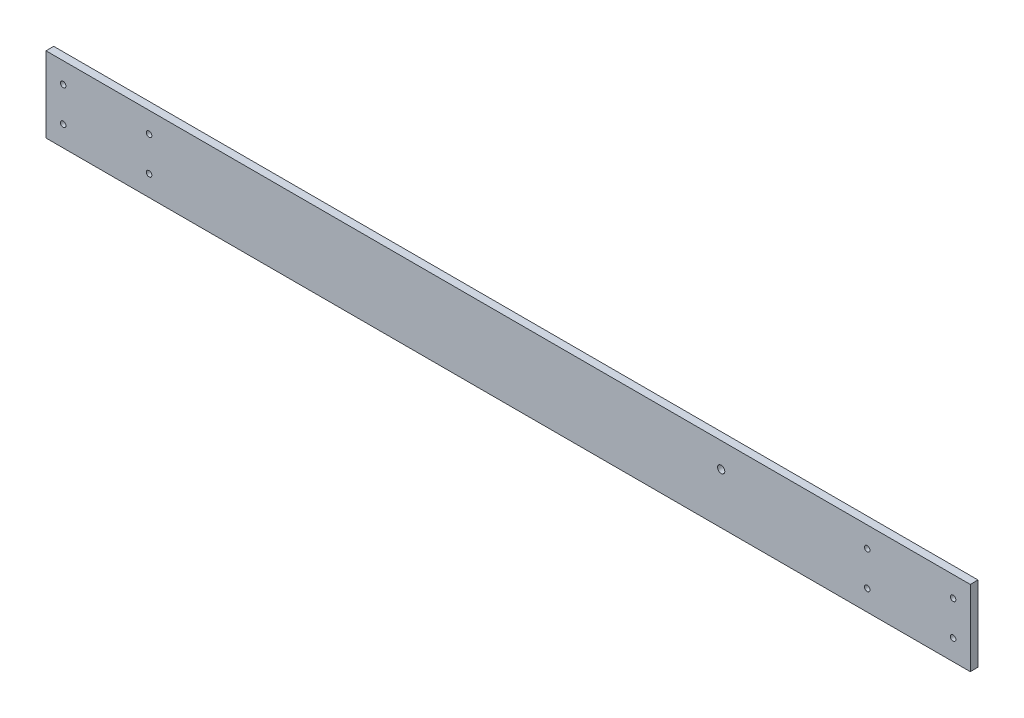
ISO-10303-21;
HEADER;
FILE_DESCRIPTION(('STEP AP214'),'2;1');
FILE_NAME('part.step','',(''),(''),'','','');
FILE_SCHEMA(('AUTOMOTIVE_DESIGN { 1 0 10303 214 1 1 1 1 }'));
ENDSEC;
DATA;
#1=APPLICATION_CONTEXT('core data for automotive mechanical design processes');
#2=APPLICATION_PROTOCOL_DEFINITION('international standard','automotive_design',2000,#1);
#3=PRODUCT_CONTEXT('',#1,'mechanical');
#4=PRODUCT('Part','Part','',(#3));
#5=PRODUCT_RELATED_PRODUCT_CATEGORY('part','',(#4));
#6=PRODUCT_DEFINITION_FORMATION('','',#4);
#7=PRODUCT_DEFINITION_CONTEXT('part definition',#1,'design');
#8=PRODUCT_DEFINITION('design','',#6,#7);
#9=PRODUCT_DEFINITION_SHAPE('','',#8);
#10=(LENGTH_UNIT() NAMED_UNIT(*) SI_UNIT(.MILLI.,.METRE.));
#11=(NAMED_UNIT(*) PLANE_ANGLE_UNIT() SI_UNIT($,.RADIAN.));
#12=(NAMED_UNIT(*) SI_UNIT($,.STERADIAN.) SOLID_ANGLE_UNIT());
#13=UNCERTAINTY_MEASURE_WITH_UNIT(LENGTH_MEASURE(1.E-05),#10,'distance_accuracy_value','');
#14=(GEOMETRIC_REPRESENTATION_CONTEXT(3) GLOBAL_UNCERTAINTY_ASSIGNED_CONTEXT((#13)) GLOBAL_UNIT_ASSIGNED_CONTEXT((#10,
#11,#12)) REPRESENTATION_CONTEXT('',''));
#15=CARTESIAN_POINT('',(0.,0.,0.));
#16=DIRECTION('',(0.,0.,1.));
#17=DIRECTION('',(1.,0.,0.));
#18=AXIS2_PLACEMENT_3D('',#15,#16,#17);
#19=CARTESIAN_POINT('',(0.,0.,4.5));
#20=DIRECTION('',(0.,0.,-1.));
#21=DIRECTION('',(-1.,0.,0.));
#22=AXIS2_PLACEMENT_3D('',#19,#20,#21);
#23=PLANE('',#22);
#24=DIRECTION('',(0.,1.,0.));
#25=VECTOR('',#24,1.);
#26=CARTESIAN_POINT('',(269.000000000001,-21.9999999999999,4.5));
#27=LINE('',#26,#25);
#28=CARTESIAN_POINT('',(269.000000000001,-21.9999999999999,4.5));
#29=VERTEX_POINT('',#28);
#30=CARTESIAN_POINT('',(269.000000000001,22.0000000000001,4.5));
#31=VERTEX_POINT('',#30);
#32=EDGE_CURVE('E85',#29,#31,#27,.T.);
#33=ORIENTED_EDGE('',*,*,#32,.T.);
#34=DIRECTION('',(-1.,0.,0.));
#35=VECTOR('',#34,1.);
#36=CARTESIAN_POINT('',(-268.999999999999,21.9999999999999,4.5));
#37=LINE('',#36,#35);
#38=CARTESIAN_POINT('',(-268.999999999999,21.9999999999999,4.5));
#39=VERTEX_POINT('',#38);
#40=EDGE_CURVE('E80',#31,#39,#37,.T.);
#41=ORIENTED_EDGE('',*,*,#40,.T.);
#42=DIRECTION('',(0.,-1.,0.));
#43=VECTOR('',#42,1.);
#44=CARTESIAN_POINT('',(-268.999999999999,-22.,4.5));
#45=LINE('',#44,#43);
#46=CARTESIAN_POINT('',(-268.999999999999,-22.,4.5));
#47=VERTEX_POINT('',#46);
#48=EDGE_CURVE('E83',#39,#47,#45,.T.);
#49=ORIENTED_EDGE('',*,*,#48,.T.);
#50=DIRECTION('',(1.,0.,0.));
#51=VECTOR('',#50,1.);
#52=CARTESIAN_POINT('',(-268.999999999999,-22.,4.5));
#53=LINE('',#52,#51);
#54=EDGE_CURVE('E50',#47,#29,#53,.T.);
#55=ORIENTED_EDGE('',*,*,#54,.T.);
#56=EDGE_LOOP('',(#33,#41,#49,#55));
#57=FACE_BOUND('',#56,.T.);
#58=CARTESIAN_POINT('',(124.000000000001,7.49999999999984,4.5));
#59=DIRECTION('',(0.,0.,1.));
#60=DIRECTION('',(1.,0.,0.));
#61=AXIS2_PLACEMENT_3D('',#58,#59,#60);
#62=CIRCLE('',#61,2.10000000000038);
#63=CARTESIAN_POINT('',(126.100000000001,7.49999999999984,4.5));
#64=VERTEX_POINT('',#63);
#65=EDGE_CURVE('E100',#64,#64,#62,.T.);
#66=ORIENTED_EDGE('',*,*,#65,.F.);
#67=EDGE_LOOP('',(#66));
#68=FACE_BOUND('',#67,.T.);
#69=CARTESIAN_POINT('',(259.000000000001,10.,4.5));
#70=DIRECTION('',(0.,0.,1.));
#71=DIRECTION('',(1.,0.,0.));
#72=AXIS2_PLACEMENT_3D('',#69,#70,#71);
#73=CIRCLE('',#72,1.59999999999996);
#74=CARTESIAN_POINT('',(260.600000000001,10.,4.5));
#75=VERTEX_POINT('',#74);
#76=EDGE_CURVE('E115',#75,#75,#73,.T.);
#77=ORIENTED_EDGE('',*,*,#76,.F.);
#78=EDGE_LOOP('',(#77));
#79=FACE_BOUND('',#78,.T.);
#80=CARTESIAN_POINT('',(209.000000000001,9.99999999999896,4.5));
#81=DIRECTION('',(0.,0.,1.));
#82=DIRECTION('',(1.,0.,0.));
#83=AXIS2_PLACEMENT_3D('',#80,#81,#82);
#84=CIRCLE('',#83,1.59999999999996);
#85=CARTESIAN_POINT('',(210.600000000001,9.99999999999896,4.5));
#86=VERTEX_POINT('',#85);
#87=EDGE_CURVE('E121',#86,#86,#84,.T.);
#88=ORIENTED_EDGE('',*,*,#87,.F.);
#89=EDGE_LOOP('',(#88));
#90=FACE_BOUND('',#89,.T.);
#91=CARTESIAN_POINT('',(-209.,9.99999999999896,4.5));
#92=DIRECTION('',(0.,0.,1.));
#93=DIRECTION('',(-1.,0.,0.));
#94=AXIS2_PLACEMENT_3D('',#91,#92,#93);
#95=CIRCLE('',#94,1.59999999999996);
#96=CARTESIAN_POINT('',(-210.6,9.99999999999896,4.5));
#97=VERTEX_POINT('',#96);
#98=EDGE_CURVE('E127',#97,#97,#95,.T.);
#99=ORIENTED_EDGE('',*,*,#98,.F.);
#100=EDGE_LOOP('',(#99));
#101=FACE_BOUND('',#100,.T.);
#102=CARTESIAN_POINT('',(-209.,-10.000000000001,4.5));
#103=DIRECTION('',(0.,0.,1.));
#104=DIRECTION('',(-1.,0.,0.));
#105=AXIS2_PLACEMENT_3D('',#102,#103,#104);
#106=CIRCLE('',#105,1.60000000000002);
#107=CARTESIAN_POINT('',(-210.6,-10.000000000001,4.5));
#108=VERTEX_POINT('',#107);
#109=EDGE_CURVE('E133',#108,#108,#106,.T.);
#110=ORIENTED_EDGE('',*,*,#109,.F.);
#111=EDGE_LOOP('',(#110));
#112=FACE_BOUND('',#111,.T.);
#113=CARTESIAN_POINT('',(209.000000000001,-10.000000000001,4.5));
#114=DIRECTION('',(0.,0.,1.));
#115=DIRECTION('',(1.,0.,0.));
#116=AXIS2_PLACEMENT_3D('',#113,#114,#115);
#117=CIRCLE('',#116,1.60000000000002);
#118=CARTESIAN_POINT('',(210.600000000001,-10.000000000001,4.5));
#119=VERTEX_POINT('',#118);
#120=EDGE_CURVE('E139',#119,#119,#117,.T.);
#121=ORIENTED_EDGE('',*,*,#120,.F.);
#122=EDGE_LOOP('',(#121));
#123=FACE_BOUND('',#122,.T.);
#124=CARTESIAN_POINT('',(-259.,-10.,4.5));
#125=DIRECTION('',(0.,0.,1.));
#126=DIRECTION('',(-1.,0.,0.));
#127=AXIS2_PLACEMENT_3D('',#124,#125,#126);
#128=CIRCLE('',#127,1.59999999999996);
#129=CARTESIAN_POINT('',(-260.6,-10.,4.5));
#130=VERTEX_POINT('',#129);
#131=EDGE_CURVE('E145',#130,#130,#128,.T.);
#132=ORIENTED_EDGE('',*,*,#131,.F.);
#133=EDGE_LOOP('',(#132));
#134=FACE_BOUND('',#133,.T.);
#135=CARTESIAN_POINT('',(-259.,10.,4.5));
#136=DIRECTION('',(0.,0.,1.));
#137=DIRECTION('',(-1.,0.,0.));
#138=AXIS2_PLACEMENT_3D('',#135,#136,#137);
#139=CIRCLE('',#138,1.59999999999996);
#140=CARTESIAN_POINT('',(-260.6,10.,4.5));
#141=VERTEX_POINT('',#140);
#142=EDGE_CURVE('E151',#141,#141,#139,.T.);
#143=ORIENTED_EDGE('',*,*,#142,.F.);
#144=EDGE_LOOP('',(#143));
#145=FACE_BOUND('',#144,.T.);
#146=CARTESIAN_POINT('',(259.000000000001,-10.,4.5));
#147=DIRECTION('',(0.,0.,1.));
#148=DIRECTION('',(1.,0.,0.));
#149=AXIS2_PLACEMENT_3D('',#146,#147,#148);
#150=CIRCLE('',#149,1.59999999999996);
#151=CARTESIAN_POINT('',(260.600000000001,-10.,4.5));
#152=VERTEX_POINT('',#151);
#153=EDGE_CURVE('E157',#152,#152,#150,.T.);
#154=ORIENTED_EDGE('',*,*,#153,.F.);
#155=EDGE_LOOP('',(#154));
#156=FACE_BOUND('',#155,.T.);
#157=ADVANCED_FACE('F33',(#57,#68,#79,#90,#101,#112,#123,#134,#145,#156),#23,.F.);
#158=CARTESIAN_POINT('',(0.,0.,0.));
#159=DIRECTION('',(0.,0.,-1.));
#160=DIRECTION('',(-1.,0.,0.));
#161=AXIS2_PLACEMENT_3D('',#158,#159,#160);
#162=PLANE('',#161);
#163=CARTESIAN_POINT('',(-259.,10.,0.));
#164=DIRECTION('',(0.,0.,1.));
#165=DIRECTION('',(-1.,0.,0.));
#166=AXIS2_PLACEMENT_3D('',#163,#164,#165);
#167=CIRCLE('',#166,1.59999999999996);
#168=CARTESIAN_POINT('',(-260.6,10.,0.));
#169=VERTEX_POINT('',#168);
#170=EDGE_CURVE('E154',#169,#169,#167,.T.);
#171=ORIENTED_EDGE('',*,*,#170,.T.);
#172=EDGE_LOOP('',(#171));
#173=FACE_BOUND('',#172,.T.);
#174=CARTESIAN_POINT('',(209.000000000001,-10.000000000001,0.));
#175=DIRECTION('',(0.,0.,1.));
#176=DIRECTION('',(1.,0.,0.));
#177=AXIS2_PLACEMENT_3D('',#174,#175,#176);
#178=CIRCLE('',#177,1.60000000000002);
#179=CARTESIAN_POINT('',(210.600000000001,-10.000000000001,0.));
#180=VERTEX_POINT('',#179);
#181=EDGE_CURVE('E142',#180,#180,#178,.T.);
#182=ORIENTED_EDGE('',*,*,#181,.T.);
#183=EDGE_LOOP('',(#182));
#184=FACE_BOUND('',#183,.T.);
#185=CARTESIAN_POINT('',(-209.,9.99999999999896,0.));
#186=DIRECTION('',(0.,0.,1.));
#187=DIRECTION('',(-1.,0.,0.));
#188=AXIS2_PLACEMENT_3D('',#185,#186,#187);
#189=CIRCLE('',#188,1.59999999999996);
#190=CARTESIAN_POINT('',(-210.6,9.99999999999896,0.));
#191=VERTEX_POINT('',#190);
#192=EDGE_CURVE('E130',#191,#191,#189,.T.);
#193=ORIENTED_EDGE('',*,*,#192,.T.);
#194=EDGE_LOOP('',(#193));
#195=FACE_BOUND('',#194,.T.);
#196=CARTESIAN_POINT('',(259.000000000001,10.,0.));
#197=DIRECTION('',(0.,0.,1.));
#198=DIRECTION('',(1.,0.,0.));
#199=AXIS2_PLACEMENT_3D('',#196,#197,#198);
#200=CIRCLE('',#199,1.59999999999996);
#201=CARTESIAN_POINT('',(260.600000000001,10.,0.));
#202=VERTEX_POINT('',#201);
#203=EDGE_CURVE('E118',#202,#202,#200,.T.);
#204=ORIENTED_EDGE('',*,*,#203,.T.);
#205=EDGE_LOOP('',(#204));
#206=FACE_BOUND('',#205,.T.);
#207=DIRECTION('',(0.,1.,0.));
#208=VECTOR('',#207,1.);
#209=CARTESIAN_POINT('',(269.000000000001,-21.9999999999999,0.));
#210=LINE('',#209,#208);
#211=CARTESIAN_POINT('',(269.000000000001,-21.9999999999999,0.));
#212=VERTEX_POINT('',#211);
#213=CARTESIAN_POINT('',(269.000000000001,22.0000000000001,0.));
#214=VERTEX_POINT('',#213);
#215=EDGE_CURVE('E97',#212,#214,#210,.T.);
#216=ORIENTED_EDGE('',*,*,#215,.F.);
#217=DIRECTION('',(1.,0.,0.));
#218=VECTOR('',#217,1.);
#219=CARTESIAN_POINT('',(-268.999999999999,-22.,0.));
#220=LINE('',#219,#218);
#221=CARTESIAN_POINT('',(-268.999999999999,-22.,0.));
#222=VERTEX_POINT('',#221);
#223=EDGE_CURVE('E73',#222,#212,#220,.T.);
#224=ORIENTED_EDGE('',*,*,#223,.F.);
#225=DIRECTION('',(0.,-1.,0.));
#226=VECTOR('',#225,1.);
#227=CARTESIAN_POINT('',(-268.999999999999,-22.,0.));
#228=LINE('',#227,#226);
#229=CARTESIAN_POINT('',(-268.999999999999,21.9999999999999,0.));
#230=VERTEX_POINT('',#229);
#231=EDGE_CURVE('E67',#230,#222,#228,.T.);
#232=ORIENTED_EDGE('',*,*,#231,.F.);
#233=DIRECTION('',(-1.,0.,0.));
#234=VECTOR('',#233,1.);
#235=CARTESIAN_POINT('',(-268.999999999999,21.9999999999999,0.));
#236=LINE('',#235,#234);
#237=EDGE_CURVE('E89',#214,#230,#236,.T.);
#238=ORIENTED_EDGE('',*,*,#237,.F.);
#239=EDGE_LOOP('',(#216,#224,#232,#238));
#240=FACE_BOUND('',#239,.T.);
#241=CARTESIAN_POINT('',(124.000000000001,7.49999999999984,0.));
#242=DIRECTION('',(0.,0.,1.));
#243=DIRECTION('',(1.,0.,0.));
#244=AXIS2_PLACEMENT_3D('',#241,#242,#243);
#245=CIRCLE('',#244,2.10000000000038);
#246=CARTESIAN_POINT('',(126.100000000001,7.49999999999984,0.));
#247=VERTEX_POINT('',#246);
#248=EDGE_CURVE('E112',#247,#247,#245,.T.);
#249=ORIENTED_EDGE('',*,*,#248,.T.);
#250=EDGE_LOOP('',(#249));
#251=FACE_BOUND('',#250,.T.);
#252=CARTESIAN_POINT('',(209.000000000001,9.99999999999896,0.));
#253=DIRECTION('',(0.,0.,1.));
#254=DIRECTION('',(1.,0.,0.));
#255=AXIS2_PLACEMENT_3D('',#252,#253,#254);
#256=CIRCLE('',#255,1.59999999999996);
#257=CARTESIAN_POINT('',(210.600000000001,9.99999999999896,0.));
#258=VERTEX_POINT('',#257);
#259=EDGE_CURVE('E124',#258,#258,#256,.T.);
#260=ORIENTED_EDGE('',*,*,#259,.T.);
#261=EDGE_LOOP('',(#260));
#262=FACE_BOUND('',#261,.T.);
#263=CARTESIAN_POINT('',(-209.,-10.000000000001,0.));
#264=DIRECTION('',(0.,0.,1.));
#265=DIRECTION('',(-1.,0.,0.));
#266=AXIS2_PLACEMENT_3D('',#263,#264,#265);
#267=CIRCLE('',#266,1.60000000000002);
#268=CARTESIAN_POINT('',(-210.6,-10.000000000001,0.));
#269=VERTEX_POINT('',#268);
#270=EDGE_CURVE('E136',#269,#269,#267,.T.);
#271=ORIENTED_EDGE('',*,*,#270,.T.);
#272=EDGE_LOOP('',(#271));
#273=FACE_BOUND('',#272,.T.);
#274=CARTESIAN_POINT('',(-259.,-10.,0.));
#275=DIRECTION('',(0.,0.,1.));
#276=DIRECTION('',(-1.,0.,0.));
#277=AXIS2_PLACEMENT_3D('',#274,#275,#276);
#278=CIRCLE('',#277,1.59999999999996);
#279=CARTESIAN_POINT('',(-260.6,-10.,0.));
#280=VERTEX_POINT('',#279);
#281=EDGE_CURVE('E148',#280,#280,#278,.T.);
#282=ORIENTED_EDGE('',*,*,#281,.T.);
#283=EDGE_LOOP('',(#282));
#284=FACE_BOUND('',#283,.T.);
#285=CARTESIAN_POINT('',(259.000000000001,-10.,0.));
#286=DIRECTION('',(0.,0.,1.));
#287=DIRECTION('',(1.,0.,0.));
#288=AXIS2_PLACEMENT_3D('',#285,#286,#287);
#289=CIRCLE('',#288,1.59999999999996);
#290=CARTESIAN_POINT('',(260.600000000001,-10.,0.));
#291=VERTEX_POINT('',#290);
#292=EDGE_CURVE('E160',#291,#291,#289,.T.);
#293=ORIENTED_EDGE('',*,*,#292,.T.);
#294=EDGE_LOOP('',(#293));
#295=FACE_BOUND('',#294,.T.);
#296=ADVANCED_FACE('F108',(#173,#184,#195,#206,#240,#251,#262,#273,#284,#295),#162,.T.);
#297=CARTESIAN_POINT('',(269.000000000001,-21.9999999999999,4.5));
#298=DIRECTION('',(-1.,0.,0.));
#299=DIRECTION('',(0.,0.,1.));
#300=AXIS2_PLACEMENT_3D('',#297,#298,#299);
#301=PLANE('',#300);
#302=ORIENTED_EDGE('',*,*,#215,.T.);
#303=DIRECTION('',(0.,0.,-1.));
#304=VECTOR('',#303,1.);
#305=CARTESIAN_POINT('',(269.000000000001,22.0000000000001,4.5));
#306=LINE('',#305,#304);
#307=EDGE_CURVE('E11',#31,#214,#306,.T.);
#308=ORIENTED_EDGE('',*,*,#307,.F.);
#309=ORIENTED_EDGE('',*,*,#32,.F.);
#310=DIRECTION('',(0.,0.,-1.));
#311=VECTOR('',#310,1.);
#312=CARTESIAN_POINT('',(269.000000000001,-21.9999999999999,4.5));
#313=LINE('',#312,#311);
#314=EDGE_CURVE('E93',#29,#212,#313,.T.);
#315=ORIENTED_EDGE('',*,*,#314,.T.);
#316=EDGE_LOOP('',(#302,#308,#309,#315));
#317=FACE_BOUND('',#316,.T.);
#318=ADVANCED_FACE('F35',(#317),#301,.F.);
#319=CARTESIAN_POINT('',(-268.999999999999,21.9999999999999,4.5));
#320=DIRECTION('',(0.,-1.,0.));
#321=DIRECTION('',(1.,0.,0.));
#322=AXIS2_PLACEMENT_3D('',#319,#320,#321);
#323=PLANE('',#322);
#324=ORIENTED_EDGE('',*,*,#237,.T.);
#325=DIRECTION('',(0.,0.,-1.));
#326=VECTOR('',#325,1.);
#327=CARTESIAN_POINT('',(-268.999999999999,21.9999999999999,4.5));
#328=LINE('',#327,#326);
#329=EDGE_CURVE('E42',#39,#230,#328,.T.);
#330=ORIENTED_EDGE('',*,*,#329,.F.);
#331=ORIENTED_EDGE('',*,*,#40,.F.);
#332=ORIENTED_EDGE('',*,*,#307,.T.);
#333=EDGE_LOOP('',(#324,#330,#331,#332));
#334=FACE_BOUND('',#333,.T.);
#335=ADVANCED_FACE('F88',(#334),#323,.F.);
#336=CARTESIAN_POINT('',(-268.999999999999,-22.,4.5));
#337=DIRECTION('',(1.,0.,0.));
#338=DIRECTION('',(0.,0.,-1.));
#339=AXIS2_PLACEMENT_3D('',#336,#337,#338);
#340=PLANE('',#339);
#341=ORIENTED_EDGE('',*,*,#231,.T.);
#342=DIRECTION('',(0.,0.,-1.));
#343=VECTOR('',#342,1.);
#344=CARTESIAN_POINT('',(-268.999999999999,-22.,4.5));
#345=LINE('',#344,#343);
#346=EDGE_CURVE('E90',#47,#222,#345,.T.);
#347=ORIENTED_EDGE('',*,*,#346,.F.);
#348=ORIENTED_EDGE('',*,*,#48,.F.);
#349=ORIENTED_EDGE('',*,*,#329,.T.);
#350=EDGE_LOOP('',(#341,#347,#348,#349));
#351=FACE_BOUND('',#350,.T.);
#352=ADVANCED_FACE('F91',(#351),#340,.F.);
#353=CARTESIAN_POINT('',(-268.999999999999,-22.,4.5));
#354=DIRECTION('',(0.,1.,0.));
#355=DIRECTION('',(-1.,0.,0.));
#356=AXIS2_PLACEMENT_3D('',#353,#354,#355);
#357=PLANE('',#356);
#358=ORIENTED_EDGE('',*,*,#223,.T.);
#359=ORIENTED_EDGE('',*,*,#314,.F.);
#360=ORIENTED_EDGE('',*,*,#54,.F.);
#361=ORIENTED_EDGE('',*,*,#346,.T.);
#362=EDGE_LOOP('',(#358,#359,#360,#361));
#363=FACE_BOUND('',#362,.T.);
#364=ADVANCED_FACE('F105',(#363),#357,.F.);
#365=CARTESIAN_POINT('',(124.000000000001,7.49999999999984,4.5));
#366=DIRECTION('',(0.,0.,-1.));
#367=DIRECTION('',(-1.,0.,0.));
#368=AXIS2_PLACEMENT_3D('',#365,#366,#367);
#369=CYLINDRICAL_SURFACE('',#368,2.10000000000038);
#370=ORIENTED_EDGE('',*,*,#65,.T.);
#371=EDGE_LOOP('',(#370));
#372=FACE_BOUND('',#371,.T.);
#373=ORIENTED_EDGE('',*,*,#248,.F.);
#374=EDGE_LOOP('',(#373));
#375=FACE_BOUND('',#374,.T.);
#376=ADVANCED_FACE('F177',(#372,#375),#369,.F.);
#377=CARTESIAN_POINT('',(259.000000000001,10.,4.5));
#378=DIRECTION('',(0.,0.,-1.));
#379=DIRECTION('',(-1.,0.,0.));
#380=AXIS2_PLACEMENT_3D('',#377,#378,#379);
#381=CYLINDRICAL_SURFACE('',#380,1.59999999999996);
#382=ORIENTED_EDGE('',*,*,#76,.T.);
#383=EDGE_LOOP('',(#382));
#384=FACE_BOUND('',#383,.T.);
#385=ORIENTED_EDGE('',*,*,#203,.F.);
#386=EDGE_LOOP('',(#385));
#387=FACE_BOUND('',#386,.T.);
#388=ADVANCED_FACE('F223',(#384,#387),#381,.F.);
#389=CARTESIAN_POINT('',(209.000000000001,9.99999999999896,4.5));
#390=DIRECTION('',(0.,0.,-1.));
#391=DIRECTION('',(-1.,0.,0.));
#392=AXIS2_PLACEMENT_3D('',#389,#390,#391);
#393=CYLINDRICAL_SURFACE('',#392,1.59999999999996);
#394=ORIENTED_EDGE('',*,*,#87,.T.);
#395=EDGE_LOOP('',(#394));
#396=FACE_BOUND('',#395,.T.);
#397=ORIENTED_EDGE('',*,*,#259,.F.);
#398=EDGE_LOOP('',(#397));
#399=FACE_BOUND('',#398,.T.);
#400=ADVANCED_FACE('F231',(#396,#399),#393,.F.);
#401=CARTESIAN_POINT('',(-209.,9.99999999999896,4.5));
#402=DIRECTION('',(0.,0.,-1.));
#403=DIRECTION('',(-1.,0.,0.));
#404=AXIS2_PLACEMENT_3D('',#401,#402,#403);
#405=CYLINDRICAL_SURFACE('',#404,1.59999999999996);
#406=ORIENTED_EDGE('',*,*,#98,.T.);
#407=EDGE_LOOP('',(#406));
#408=FACE_BOUND('',#407,.T.);
#409=ORIENTED_EDGE('',*,*,#192,.F.);
#410=EDGE_LOOP('',(#409));
#411=FACE_BOUND('',#410,.T.);
#412=ADVANCED_FACE('F239',(#408,#411),#405,.F.);
#413=CARTESIAN_POINT('',(-209.,-10.000000000001,4.5));
#414=DIRECTION('',(0.,0.,-1.));
#415=DIRECTION('',(-1.,0.,0.));
#416=AXIS2_PLACEMENT_3D('',#413,#414,#415);
#417=CYLINDRICAL_SURFACE('',#416,1.60000000000002);
#418=ORIENTED_EDGE('',*,*,#109,.T.);
#419=EDGE_LOOP('',(#418));
#420=FACE_BOUND('',#419,.T.);
#421=ORIENTED_EDGE('',*,*,#270,.F.);
#422=EDGE_LOOP('',(#421));
#423=FACE_BOUND('',#422,.T.);
#424=ADVANCED_FACE('F248',(#420,#423),#417,.F.);
#425=CARTESIAN_POINT('',(209.000000000001,-10.000000000001,4.5));
#426=DIRECTION('',(0.,0.,-1.));
#427=DIRECTION('',(-1.,0.,0.));
#428=AXIS2_PLACEMENT_3D('',#425,#426,#427);
#429=CYLINDRICAL_SURFACE('',#428,1.60000000000002);
#430=ORIENTED_EDGE('',*,*,#120,.T.);
#431=EDGE_LOOP('',(#430));
#432=FACE_BOUND('',#431,.T.);
#433=ORIENTED_EDGE('',*,*,#181,.F.);
#434=EDGE_LOOP('',(#433));
#435=FACE_BOUND('',#434,.T.);
#436=ADVANCED_FACE('F257',(#432,#435),#429,.F.);
#437=CARTESIAN_POINT('',(-259.,-10.,4.5));
#438=DIRECTION('',(0.,0.,-1.));
#439=DIRECTION('',(-1.,0.,0.));
#440=AXIS2_PLACEMENT_3D('',#437,#438,#439);
#441=CYLINDRICAL_SURFACE('',#440,1.59999999999996);
#442=ORIENTED_EDGE('',*,*,#131,.T.);
#443=EDGE_LOOP('',(#442));
#444=FACE_BOUND('',#443,.T.);
#445=ORIENTED_EDGE('',*,*,#281,.F.);
#446=EDGE_LOOP('',(#445));
#447=FACE_BOUND('',#446,.T.);
#448=ADVANCED_FACE('F266',(#444,#447),#441,.F.);
#449=CARTESIAN_POINT('',(-259.,10.,4.5));
#450=DIRECTION('',(0.,0.,-1.));
#451=DIRECTION('',(-1.,0.,0.));
#452=AXIS2_PLACEMENT_3D('',#449,#450,#451);
#453=CYLINDRICAL_SURFACE('',#452,1.59999999999996);
#454=ORIENTED_EDGE('',*,*,#142,.T.);
#455=EDGE_LOOP('',(#454));
#456=FACE_BOUND('',#455,.T.);
#457=ORIENTED_EDGE('',*,*,#170,.F.);
#458=EDGE_LOOP('',(#457));
#459=FACE_BOUND('',#458,.T.);
#460=ADVANCED_FACE('F275',(#456,#459),#453,.F.);
#461=CARTESIAN_POINT('',(259.000000000001,-10.,4.5));
#462=DIRECTION('',(0.,0.,-1.));
#463=DIRECTION('',(-1.,0.,0.));
#464=AXIS2_PLACEMENT_3D('',#461,#462,#463);
#465=CYLINDRICAL_SURFACE('',#464,1.59999999999996);
#466=ORIENTED_EDGE('',*,*,#153,.T.);
#467=EDGE_LOOP('',(#466));
#468=FACE_BOUND('',#467,.T.);
#469=ORIENTED_EDGE('',*,*,#292,.F.);
#470=EDGE_LOOP('',(#469));
#471=FACE_BOUND('',#470,.T.);
#472=ADVANCED_FACE('F166',(#468,#471),#465,.F.);
#473=CLOSED_SHELL('',(#157,#296,#318,#335,#352,#364,#376,#388,#400,#412,#424,#436,#448,#460,#472));
#474=MANIFOLD_SOLID_BREP('B2',#473);
#475=ADVANCED_BREP_SHAPE_REPRESENTATION('',(#18,#474),#14);
#476=SHAPE_DEFINITION_REPRESENTATION(#9,#475);
ENDSEC;
END-ISO-10303-21;
